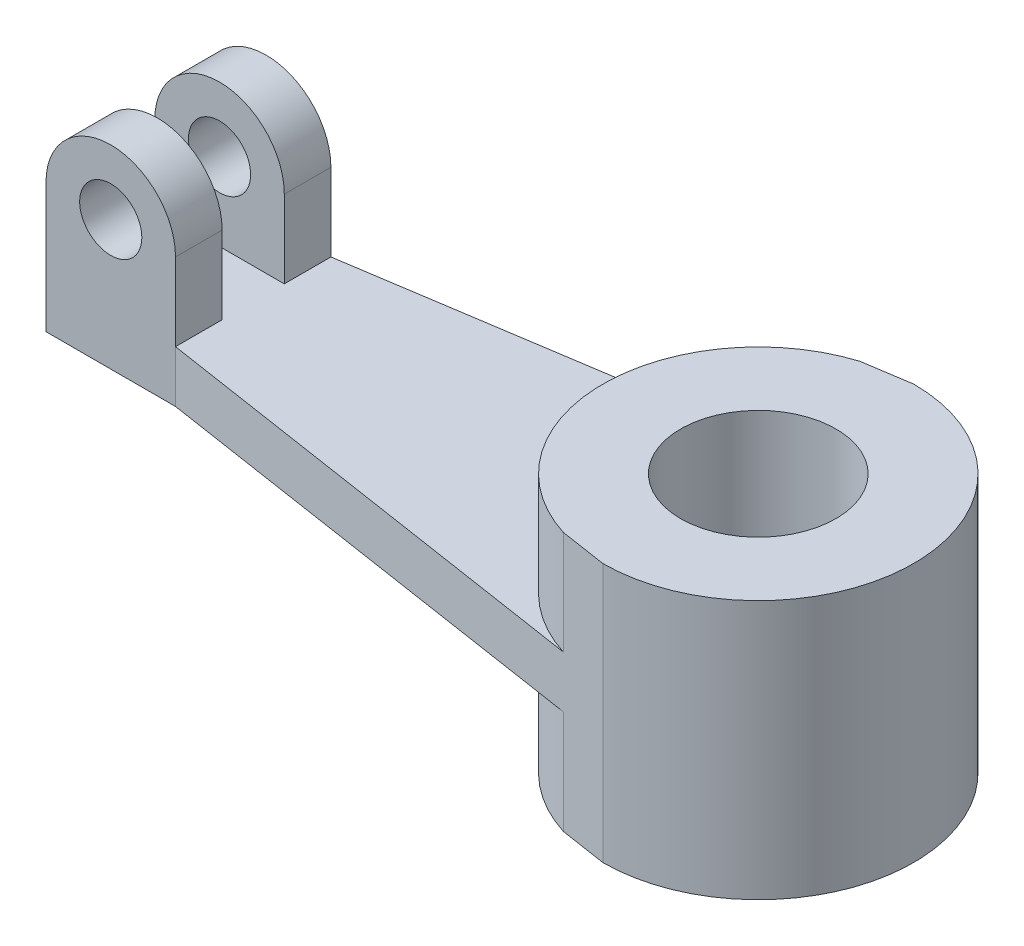
ISO-10303-21;
HEADER;
FILE_DESCRIPTION(('STEP AP214'),'2;1');
FILE_NAME('part.step','',(''),(''),'','','');
FILE_SCHEMA(('AUTOMOTIVE_DESIGN { 1 0 10303 214 1 1 1 1 }'));
ENDSEC;
DATA;
#1=APPLICATION_CONTEXT('core data for automotive mechanical design processes');
#2=APPLICATION_PROTOCOL_DEFINITION('international standard','automotive_design',2000,#1);
#3=PRODUCT_CONTEXT('',#1,'mechanical');
#4=PRODUCT('Part','Part','',(#3));
#5=PRODUCT_RELATED_PRODUCT_CATEGORY('part','',(#4));
#6=PRODUCT_DEFINITION_FORMATION('','',#4);
#7=PRODUCT_DEFINITION_CONTEXT('part definition',#1,'design');
#8=PRODUCT_DEFINITION('design','',#6,#7);
#9=PRODUCT_DEFINITION_SHAPE('','',#8);
#10=(LENGTH_UNIT() NAMED_UNIT(*) SI_UNIT(.MILLI.,.METRE.));
#11=(NAMED_UNIT(*) PLANE_ANGLE_UNIT() SI_UNIT($,.RADIAN.));
#12=(NAMED_UNIT(*) SI_UNIT($,.STERADIAN.) SOLID_ANGLE_UNIT());
#13=UNCERTAINTY_MEASURE_WITH_UNIT(LENGTH_MEASURE(1.E-05),#10,'distance_accuracy_value','');
#14=(GEOMETRIC_REPRESENTATION_CONTEXT(3) GLOBAL_UNCERTAINTY_ASSIGNED_CONTEXT((#13)) GLOBAL_UNIT_ASSIGNED_CONTEXT((#10,
#11,#12)) REPRESENTATION_CONTEXT('',''));
#15=CARTESIAN_POINT('',(0.,0.,0.));
#16=DIRECTION('',(0.,0.,1.));
#17=DIRECTION('',(1.,0.,0.));
#18=AXIS2_PLACEMENT_3D('',#15,#16,#17);
#19=CARTESIAN_POINT('',(0.,10.,0.));
#20=DIRECTION('',(0.,1.,0.));
#21=DIRECTION('',(0.,0.,1.));
#22=AXIS2_PLACEMENT_3D('',#19,#20,#21);
#23=PLANE('',#22);
#24=DIRECTION('',(-1.,0.,0.));
#25=VECTOR('',#24,1.);
#26=CARTESIAN_POINT('',(-122.5,10.,6.));
#27=LINE('',#26,#25);
#28=CARTESIAN_POINT('',(-97.5,10.,6.));
#29=VERTEX_POINT('',#28);
#30=CARTESIAN_POINT('',(-122.5,10.,6.));
#31=VERTEX_POINT('',#30);
#32=EDGE_CURVE('E51',#29,#31,#27,.T.);
#33=ORIENTED_EDGE('',*,*,#32,.F.);
#34=DIRECTION('',(0.,0.,-1.));
#35=VECTOR('',#34,1.);
#36=CARTESIAN_POINT('',(-97.5,10.,6.));
#37=LINE('',#36,#35);
#38=CARTESIAN_POINT('',(-97.5,10.,15.));
#39=VERTEX_POINT('',#38);
#40=EDGE_CURVE('E181',#39,#29,#37,.T.);
#41=ORIENTED_EDGE('',*,*,#40,.F.);
#42=DIRECTION('',(0.988371697650617,0.,0.152057184253941));
#43=VECTOR('',#42,1.);
#44=CARTESIAN_POINT('',(-4.50867052023121,10.,29.3063583815029));
#45=LINE('',#44,#43);
#46=CARTESIAN_POINT('',(-9.01734104046244,10.,28.6127167630058));
#47=VERTEX_POINT('',#46);
#48=EDGE_CURVE('E254',#39,#47,#45,.T.);
#49=ORIENTED_EDGE('',*,*,#48,.T.);
#50=CARTESIAN_POINT('',(0.,10.,0.));
#51=DIRECTION('',(0.,1.,0.));
#52=DIRECTION('',(0.,0.,1.));
#53=AXIS2_PLACEMENT_3D('',#50,#51,#52);
#54=CIRCLE('',#53,30.);
#55=CARTESIAN_POINT('',(-9.01734104046243,10.,-28.6127167630058));
#56=VERTEX_POINT('',#55);
#57=EDGE_CURVE('E246',#56,#47,#54,.T.);
#58=ORIENTED_EDGE('',*,*,#57,.F.);
#59=DIRECTION('',(0.988371697650617,0.,-0.152057184253941));
#60=VECTOR('',#59,1.);
#61=CARTESIAN_POINT('',(-4.50867052023121,10.,-29.3063583815029));
#62=LINE('',#61,#60);
#63=CARTESIAN_POINT('',(-97.5,10.,-15.));
#64=VERTEX_POINT('',#63);
#65=EDGE_CURVE('E256',#64,#56,#62,.T.);
#66=ORIENTED_EDGE('',*,*,#65,.F.);
#67=DIRECTION('',(0.,0.,-1.));
#68=VECTOR('',#67,1.);
#69=CARTESIAN_POINT('',(-97.5,10.,-6.));
#70=LINE('',#69,#68);
#71=CARTESIAN_POINT('',(-97.5,10.,-6.));
#72=VERTEX_POINT('',#71);
#73=EDGE_CURVE('E154',#72,#64,#70,.T.);
#74=ORIENTED_EDGE('',*,*,#73,.F.);
#75=DIRECTION('',(1.,0.,0.));
#76=VECTOR('',#75,1.);
#77=CARTESIAN_POINT('',(-122.5,10.,-6.));
#78=LINE('',#77,#76);
#79=CARTESIAN_POINT('',(-122.5,10.,-6.));
#80=VERTEX_POINT('',#79);
#81=EDGE_CURVE('E200',#80,#72,#78,.T.);
#82=ORIENTED_EDGE('',*,*,#81,.F.);
#83=DIRECTION('',(0.,0.,1.));
#84=VECTOR('',#83,1.);
#85=CARTESIAN_POINT('',(-122.5,10.,0.));
#86=LINE('',#85,#84);
#87=EDGE_CURVE('E56',#80,#31,#86,.T.);
#88=ORIENTED_EDGE('',*,*,#87,.T.);
#89=EDGE_LOOP('',(#33,#41,#49,#58,#66,#74,#82,#88));
#90=FACE_BOUND('',#89,.T.);
#91=ADVANCED_FACE('F35',(#90),#23,.T.);
#92=CARTESIAN_POINT('',(-4.50867052023121,10.,29.3063583815029));
#93=DIRECTION('',(0.152057184253941,0.,-0.988371697650617));
#94=DIRECTION('',(-0.988371697650617,0.,-0.152057184253941));
#95=AXIS2_PLACEMENT_3D('',#92,#93,#94);
#96=PLANE('',#95);
#97=DIRECTION('',(0.988371697650617,0.,0.152057184253941));
#98=VECTOR('',#97,1.);
#99=CARTESIAN_POINT('',(-4.50867052023121,0.,29.3063583815029));
#100=LINE('',#99,#98);
#101=CARTESIAN_POINT('',(-97.5,0.,15.));
#102=VERTEX_POINT('',#101);
#103=CARTESIAN_POINT('',(-9.01734104046243,0.,28.6127167630058));
#104=VERTEX_POINT('',#103);
#105=EDGE_CURVE('E253',#102,#104,#100,.T.);
#106=ORIENTED_EDGE('',*,*,#105,.T.);
#107=DIRECTION('',(0.,1.,0.));
#108=VECTOR('',#107,1.);
#109=CARTESIAN_POINT('',(-9.01734104046244,-20.,28.6127167630058));
#110=LINE('',#109,#108);
#111=CARTESIAN_POINT('',(-9.01734104046244,-20.,28.6127167630058));
#112=VERTEX_POINT('',#111);
#113=EDGE_CURVE('E244',#112,#104,#110,.T.);
#114=ORIENTED_EDGE('',*,*,#113,.F.);
#115=DIRECTION('',(0.988371697650617,0.,0.152057184253941));
#116=VECTOR('',#115,1.);
#117=CARTESIAN_POINT('',(-4.50867052023121,-20.,29.3063583815029));
#118=LINE('',#117,#116);
#119=CARTESIAN_POINT('',(0.,-20.,30.));
#120=VERTEX_POINT('',#119);
#121=EDGE_CURVE('E237',#112,#120,#118,.T.);
#122=ORIENTED_EDGE('',*,*,#121,.T.);
#123=DIRECTION('',(0.,-1.,0.));
#124=VECTOR('',#123,1.);
#125=CARTESIAN_POINT('',(0.,10.,30.));
#126=LINE('',#125,#124);
#127=CARTESIAN_POINT('',(0.,30.,30.));
#128=VERTEX_POINT('',#127);
#129=EDGE_CURVE('E44',#128,#120,#126,.T.);
#130=ORIENTED_EDGE('',*,*,#129,.F.);
#131=DIRECTION('',(0.988371697650617,0.,0.152057184253941));
#132=VECTOR('',#131,1.);
#133=CARTESIAN_POINT('',(-4.50867052023121,30.,29.3063583815029));
#134=LINE('',#133,#132);
#135=CARTESIAN_POINT('',(-9.01734104046244,30.,28.6127167630058));
#136=VERTEX_POINT('',#135);
#137=EDGE_CURVE('E225',#136,#128,#134,.T.);
#138=ORIENTED_EDGE('',*,*,#137,.F.);
#139=EDGE_CURVE('E247',#47,#136,#110,.T.);
#140=ORIENTED_EDGE('',*,*,#139,.F.);
#141=ORIENTED_EDGE('',*,*,#48,.F.);
#142=DIRECTION('',(0.,-1.,0.));
#143=VECTOR('',#142,1.);
#144=CARTESIAN_POINT('',(-97.5,10.,15.));
#145=LINE('',#144,#143);
#146=EDGE_CURVE('E261',#39,#102,#145,.T.);
#147=ORIENTED_EDGE('',*,*,#146,.T.);
#148=EDGE_LOOP('',(#106,#114,#122,#130,#138,#140,#141,#147));
#149=FACE_BOUND('',#148,.T.);
#150=ADVANCED_FACE('F37',(#149),#96,.F.);
#151=CARTESIAN_POINT('',(0.,10.,0.));
#152=DIRECTION('',(0.,-1.,0.));
#153=DIRECTION('',(0.,0.,-1.));
#154=AXIS2_PLACEMENT_3D('',#151,#152,#153);
#155=CYLINDRICAL_SURFACE('',#154,30.);
#156=ORIENTED_EDGE('',*,*,#129,.T.);
#157=CARTESIAN_POINT('',(0.,-20.,0.));
#158=DIRECTION('',(0.,1.,0.));
#159=DIRECTION('',(0.,0.,1.));
#160=AXIS2_PLACEMENT_3D('',#157,#158,#159);
#161=CIRCLE('',#160,30.);
#162=CARTESIAN_POINT('',(0.,-20.,-30.));
#163=VERTEX_POINT('',#162);
#164=EDGE_CURVE('E240',#120,#163,#161,.T.);
#165=ORIENTED_EDGE('',*,*,#164,.T.);
#166=DIRECTION('',(0.,-1.,0.));
#167=VECTOR('',#166,1.);
#168=CARTESIAN_POINT('',(0.,10.,-30.));
#169=LINE('',#168,#167);
#170=CARTESIAN_POINT('',(0.,30.,-30.));
#171=VERTEX_POINT('',#170);
#172=EDGE_CURVE('E276',#171,#163,#169,.T.);
#173=ORIENTED_EDGE('',*,*,#172,.F.);
#174=CARTESIAN_POINT('',(0.,30.,0.));
#175=DIRECTION('',(0.,1.,0.));
#176=DIRECTION('',(0.,0.,1.));
#177=AXIS2_PLACEMENT_3D('',#174,#175,#176);
#178=CIRCLE('',#177,30.);
#179=EDGE_CURVE('E228',#128,#171,#178,.T.);
#180=ORIENTED_EDGE('',*,*,#179,.F.);
#181=EDGE_LOOP('',(#156,#165,#173,#180));
#182=FACE_BOUND('',#181,.T.);
#183=ADVANCED_FACE('F280',(#182),#155,.T.);
#184=CARTESIAN_POINT('',(-4.50867052023121,10.,-29.3063583815029));
#185=DIRECTION('',(-0.152057184253941,0.,-0.988371697650617));
#186=DIRECTION('',(-0.988371697650617,0.,0.152057184253941));
#187=AXIS2_PLACEMENT_3D('',#184,#185,#186);
#188=PLANE('',#187);
#189=ORIENTED_EDGE('',*,*,#65,.T.);
#190=DIRECTION('',(0.,1.,0.));
#191=VECTOR('',#190,1.);
#192=CARTESIAN_POINT('',(-9.01734104046244,-20.,-28.6127167630058));
#193=LINE('',#192,#191);
#194=CARTESIAN_POINT('',(-9.01734104046244,30.,-28.6127167630058));
#195=VERTEX_POINT('',#194);
#196=EDGE_CURVE('E243',#56,#195,#193,.T.);
#197=ORIENTED_EDGE('',*,*,#196,.T.);
#198=DIRECTION('',(-0.988371697650617,0.,0.152057184253941));
#199=VECTOR('',#198,1.);
#200=CARTESIAN_POINT('',(-4.50867052023121,30.,-29.3063583815029));
#201=LINE('',#200,#199);
#202=EDGE_CURVE('E217',#171,#195,#201,.T.);
#203=ORIENTED_EDGE('',*,*,#202,.F.);
#204=ORIENTED_EDGE('',*,*,#172,.T.);
#205=DIRECTION('',(-0.988371697650617,0.,0.152057184253941));
#206=VECTOR('',#205,1.);
#207=CARTESIAN_POINT('',(-4.50867052023121,-20.,-29.3063583815029));
#208=LINE('',#207,#206);
#209=CARTESIAN_POINT('',(-9.01734104046244,-20.,-28.6127167630058));
#210=VERTEX_POINT('',#209);
#211=EDGE_CURVE('E231',#163,#210,#208,.T.);
#212=ORIENTED_EDGE('',*,*,#211,.T.);
#213=CARTESIAN_POINT('',(-9.01734104046244,0.,-28.6127167630058));
#214=VERTEX_POINT('',#213);
#215=EDGE_CURVE('E248',#210,#214,#193,.T.);
#216=ORIENTED_EDGE('',*,*,#215,.T.);
#217=DIRECTION('',(0.988371697650617,0.,-0.152057184253941));
#218=VECTOR('',#217,1.);
#219=CARTESIAN_POINT('',(-4.50867052023121,0.,-29.3063583815029));
#220=LINE('',#219,#218);
#221=CARTESIAN_POINT('',(-97.5,0.,-15.));
#222=VERTEX_POINT('',#221);
#223=EDGE_CURVE('E264',#222,#214,#220,.T.);
#224=ORIENTED_EDGE('',*,*,#223,.F.);
#225=DIRECTION('',(0.,-1.,0.));
#226=VECTOR('',#225,1.);
#227=CARTESIAN_POINT('',(-97.5,10.,-15.));
#228=LINE('',#227,#226);
#229=EDGE_CURVE('E163',#64,#222,#228,.T.);
#230=ORIENTED_EDGE('',*,*,#229,.F.);
#231=EDGE_LOOP('',(#189,#197,#203,#204,#212,#216,#224,#230));
#232=FACE_BOUND('',#231,.T.);
#233=ADVANCED_FACE('F290',(#232),#188,.T.);
#234=CARTESIAN_POINT('',(0.,10.,-15.));
#235=DIRECTION('',(0.,0.,1.));
#236=DIRECTION('',(1.,0.,0.));
#237=AXIS2_PLACEMENT_3D('',#234,#235,#236);
#238=PLANE('',#237);
#239=CARTESIAN_POINT('',(-110.,25.,-15.));
#240=DIRECTION('',(0.,0.,1.));
#241=DIRECTION('',(1.,0.,0.));
#242=AXIS2_PLACEMENT_3D('',#239,#240,#241);
#243=CIRCLE('',#242,6.);
#244=CARTESIAN_POINT('',(-104.,25.,-15.));
#245=VERTEX_POINT('',#244);
#246=EDGE_CURVE('E170',#245,#245,#243,.T.);
#247=ORIENTED_EDGE('',*,*,#246,.T.);
#248=EDGE_LOOP('',(#247));
#249=FACE_BOUND('',#248,.T.);
#250=DIRECTION('',(-1.,0.,0.));
#251=VECTOR('',#250,1.);
#252=CARTESIAN_POINT('',(0.,0.,-15.));
#253=LINE('',#252,#251);
#254=CARTESIAN_POINT('',(-122.5,0.,-15.));
#255=VERTEX_POINT('',#254);
#256=EDGE_CURVE('E162',#222,#255,#253,.T.);
#257=ORIENTED_EDGE('',*,*,#256,.T.);
#258=DIRECTION('',(0.,-1.,0.));
#259=VECTOR('',#258,1.);
#260=CARTESIAN_POINT('',(-122.5,10.,-15.));
#261=LINE('',#260,#259);
#262=CARTESIAN_POINT('',(-122.5,25.,-15.));
#263=VERTEX_POINT('',#262);
#264=EDGE_CURVE('E145',#263,#255,#261,.T.);
#265=ORIENTED_EDGE('',*,*,#264,.F.);
#266=CARTESIAN_POINT('',(-110.,25.,-15.));
#267=DIRECTION('',(0.,0.,-1.));
#268=DIRECTION('',(1.,0.,0.));
#269=AXIS2_PLACEMENT_3D('',#266,#267,#268);
#270=CIRCLE('',#269,12.5);
#271=CARTESIAN_POINT('',(-97.5,25.,-15.));
#272=VERTEX_POINT('',#271);
#273=EDGE_CURVE('E160',#263,#272,#270,.T.);
#274=ORIENTED_EDGE('',*,*,#273,.T.);
#275=DIRECTION('',(0.,-1.,0.));
#276=VECTOR('',#275,1.);
#277=CARTESIAN_POINT('',(-97.5,25.,-15.));
#278=LINE('',#277,#276);
#279=EDGE_CURVE('E203',#272,#64,#278,.T.);
#280=ORIENTED_EDGE('',*,*,#279,.T.);
#281=ORIENTED_EDGE('',*,*,#229,.T.);
#282=EDGE_LOOP('',(#257,#265,#274,#280,#281));
#283=FACE_BOUND('',#282,.T.);
#284=ADVANCED_FACE('F158',(#249,#283),#238,.F.);
#285=CARTESIAN_POINT('',(-122.5,10.,0.));
#286=DIRECTION('',(1.,0.,0.));
#287=DIRECTION('',(0.,0.,-1.));
#288=AXIS2_PLACEMENT_3D('',#285,#286,#287);
#289=PLANE('',#288);
#290=DIRECTION('',(0.,0.,1.));
#291=VECTOR('',#290,1.);
#292=CARTESIAN_POINT('',(-122.5,0.,0.));
#293=LINE('',#292,#291);
#294=CARTESIAN_POINT('',(-122.5,0.,15.));
#295=VERTEX_POINT('',#294);
#296=EDGE_CURVE('E268',#255,#295,#293,.T.);
#297=ORIENTED_EDGE('',*,*,#296,.T.);
#298=DIRECTION('',(0.,-1.,0.));
#299=VECTOR('',#298,1.);
#300=CARTESIAN_POINT('',(-122.5,10.,15.));
#301=LINE('',#300,#299);
#302=CARTESIAN_POINT('',(-122.5,25.,15.));
#303=VERTEX_POINT('',#302);
#304=EDGE_CURVE('E164',#303,#295,#301,.T.);
#305=ORIENTED_EDGE('',*,*,#304,.F.);
#306=DIRECTION('',(0.,0.,1.));
#307=VECTOR('',#306,1.);
#308=CARTESIAN_POINT('',(-122.5,25.,15.));
#309=LINE('',#308,#307);
#310=CARTESIAN_POINT('',(-122.5,25.,6.));
#311=VERTEX_POINT('',#310);
#312=EDGE_CURVE('E184',#311,#303,#309,.T.);
#313=ORIENTED_EDGE('',*,*,#312,.F.);
#314=DIRECTION('',(0.,-1.,0.));
#315=VECTOR('',#314,1.);
#316=CARTESIAN_POINT('',(-122.5,25.,6.));
#317=LINE('',#316,#315);
#318=EDGE_CURVE('E190',#311,#31,#317,.T.);
#319=ORIENTED_EDGE('',*,*,#318,.T.);
#320=ORIENTED_EDGE('',*,*,#87,.F.);
#321=DIRECTION('',(0.,-1.,0.));
#322=VECTOR('',#321,1.);
#323=CARTESIAN_POINT('',(-122.5,25.,-6.));
#324=LINE('',#323,#322);
#325=CARTESIAN_POINT('',(-122.5,25.,-6.));
#326=VERTEX_POINT('',#325);
#327=EDGE_CURVE('E148',#326,#80,#324,.T.);
#328=ORIENTED_EDGE('',*,*,#327,.F.);
#329=DIRECTION('',(0.,0.,1.));
#330=VECTOR('',#329,1.);
#331=CARTESIAN_POINT('',(-122.5,25.,-15.));
#332=LINE('',#331,#330);
#333=EDGE_CURVE('E142',#263,#326,#332,.T.);
#334=ORIENTED_EDGE('',*,*,#333,.F.);
#335=ORIENTED_EDGE('',*,*,#264,.T.);
#336=EDGE_LOOP('',(#297,#305,#313,#319,#320,#328,#334,#335));
#337=FACE_BOUND('',#336,.T.);
#338=ADVANCED_FACE('F144',(#337),#289,.F.);
#339=CARTESIAN_POINT('',(0.,10.,15.));
#340=DIRECTION('',(0.,0.,-1.));
#341=DIRECTION('',(-1.,0.,0.));
#342=AXIS2_PLACEMENT_3D('',#339,#340,#341);
#343=PLANE('',#342);
#344=CARTESIAN_POINT('',(-110.,25.,15.));
#345=DIRECTION('',(0.,0.,1.));
#346=DIRECTION('',(1.,0.,0.));
#347=AXIS2_PLACEMENT_3D('',#344,#345,#346);
#348=CIRCLE('',#347,6.);
#349=CARTESIAN_POINT('',(-104.,25.,15.));
#350=VERTEX_POINT('',#349);
#351=EDGE_CURVE('E462',#350,#350,#348,.T.);
#352=ORIENTED_EDGE('',*,*,#351,.F.);
#353=EDGE_LOOP('',(#352));
#354=FACE_BOUND('',#353,.T.);
#355=DIRECTION('',(1.,0.,0.));
#356=VECTOR('',#355,1.);
#357=CARTESIAN_POINT('',(0.,0.,15.));
#358=LINE('',#357,#356);
#359=EDGE_CURVE('E257',#295,#102,#358,.T.);
#360=ORIENTED_EDGE('',*,*,#359,.T.);
#361=ORIENTED_EDGE('',*,*,#146,.F.);
#362=DIRECTION('',(0.,-1.,0.));
#363=VECTOR('',#362,1.);
#364=CARTESIAN_POINT('',(-97.5,25.,15.));
#365=LINE('',#364,#363);
#366=CARTESIAN_POINT('',(-97.5,25.,15.));
#367=VERTEX_POINT('',#366);
#368=EDGE_CURVE('E198',#367,#39,#365,.T.);
#369=ORIENTED_EDGE('',*,*,#368,.F.);
#370=CARTESIAN_POINT('',(-110.,25.,15.));
#371=DIRECTION('',(0.,0.,1.));
#372=DIRECTION('',(1.,0.,0.));
#373=AXIS2_PLACEMENT_3D('',#370,#371,#372);
#374=CIRCLE('',#373,12.5);
#375=EDGE_CURVE('E172',#303,#367,#374,.F.);
#376=ORIENTED_EDGE('',*,*,#375,.F.);
#377=ORIENTED_EDGE('',*,*,#304,.T.);
#378=EDGE_LOOP('',(#360,#361,#369,#376,#377));
#379=FACE_BOUND('',#378,.T.);
#380=ADVANCED_FACE('F309',(#354,#379),#343,.F.);
#381=CARTESIAN_POINT('',(0.,0.,0.));
#382=DIRECTION('',(0.,1.,0.));
#383=DIRECTION('',(0.,0.,1.));
#384=AXIS2_PLACEMENT_3D('',#381,#382,#383);
#385=PLANE('',#384);
#386=ORIENTED_EDGE('',*,*,#223,.T.);
#387=CARTESIAN_POINT('',(0.,0.,0.));
#388=DIRECTION('',(0.,1.,0.));
#389=DIRECTION('',(0.,0.,1.));
#390=AXIS2_PLACEMENT_3D('',#387,#388,#389);
#391=CIRCLE('',#390,30.);
#392=EDGE_CURVE('E11',#214,#104,#391,.T.);
#393=ORIENTED_EDGE('',*,*,#392,.T.);
#394=ORIENTED_EDGE('',*,*,#105,.F.);
#395=ORIENTED_EDGE('',*,*,#359,.F.);
#396=ORIENTED_EDGE('',*,*,#296,.F.);
#397=ORIENTED_EDGE('',*,*,#256,.F.);
#398=EDGE_LOOP('',(#386,#393,#394,#395,#396,#397));
#399=FACE_BOUND('',#398,.T.);
#400=ADVANCED_FACE('F303',(#399),#385,.F.);
#401=CARTESIAN_POINT('',(0.,-20.,0.));
#402=DIRECTION('',(0.,1.,0.));
#403=DIRECTION('',(0.,0.,1.));
#404=AXIS2_PLACEMENT_3D('',#401,#402,#403);
#405=PLANE('',#404);
#406=CARTESIAN_POINT('',(0.,-20.,0.));
#407=DIRECTION('',(0.,1.,0.));
#408=DIRECTION('',(0.,0.,1.));
#409=AXIS2_PLACEMENT_3D('',#406,#407,#408);
#410=CIRCLE('',#409,15.);
#411=CARTESIAN_POINT('',(0.,-20.,15.));
#412=VERTEX_POINT('',#411);
#413=EDGE_CURVE('E214',#412,#412,#410,.T.);
#414=ORIENTED_EDGE('',*,*,#413,.T.);
#415=EDGE_LOOP('',(#414));
#416=FACE_BOUND('',#415,.T.);
#417=ORIENTED_EDGE('',*,*,#211,.F.);
#418=ORIENTED_EDGE('',*,*,#164,.F.);
#419=ORIENTED_EDGE('',*,*,#121,.F.);
#420=CARTESIAN_POINT('',(0.,-20.,0.));
#421=DIRECTION('',(0.,1.,0.));
#422=DIRECTION('',(0.,0.,1.));
#423=AXIS2_PLACEMENT_3D('',#420,#421,#422);
#424=CIRCLE('',#423,30.);
#425=EDGE_CURVE('E234',#210,#112,#424,.T.);
#426=ORIENTED_EDGE('',*,*,#425,.F.);
#427=EDGE_LOOP('',(#417,#418,#419,#426));
#428=FACE_BOUND('',#427,.T.);
#429=ADVANCED_FACE('F288',(#416,#428),#405,.F.);
#430=CARTESIAN_POINT('',(0.,-20.,0.));
#431=DIRECTION('',(0.,1.,0.));
#432=DIRECTION('',(0.,0.,1.));
#433=AXIS2_PLACEMENT_3D('',#430,#431,#432);
#434=CYLINDRICAL_SURFACE('',#433,30.);
#435=ORIENTED_EDGE('',*,*,#392,.F.);
#436=ORIENTED_EDGE('',*,*,#215,.F.);
#437=ORIENTED_EDGE('',*,*,#425,.T.);
#438=ORIENTED_EDGE('',*,*,#113,.T.);
#439=EDGE_LOOP('',(#435,#436,#437,#438));
#440=FACE_BOUND('',#439,.T.);
#441=ADVANCED_FACE('F385',(#440),#434,.T.);
#442=ORIENTED_EDGE('',*,*,#196,.F.);
#443=ORIENTED_EDGE('',*,*,#57,.T.);
#444=ORIENTED_EDGE('',*,*,#139,.T.);
#445=CARTESIAN_POINT('',(0.,30.,0.));
#446=DIRECTION('',(0.,1.,0.));
#447=DIRECTION('',(0.,0.,1.));
#448=AXIS2_PLACEMENT_3D('',#445,#446,#447);
#449=CIRCLE('',#448,30.);
#450=EDGE_CURVE('E222',#195,#136,#449,.T.);
#451=ORIENTED_EDGE('',*,*,#450,.F.);
#452=EDGE_LOOP('',(#442,#443,#444,#451));
#453=FACE_BOUND('',#452,.T.);
#454=ADVANCED_FACE('F300',(#453),#434,.T.);
#455=CARTESIAN_POINT('',(0.,30.,0.));
#456=DIRECTION('',(0.,1.,0.));
#457=DIRECTION('',(0.,0.,1.));
#458=AXIS2_PLACEMENT_3D('',#455,#456,#457);
#459=PLANE('',#458);
#460=CARTESIAN_POINT('',(0.,30.,0.));
#461=DIRECTION('',(0.,1.,0.));
#462=DIRECTION('',(0.,0.,1.));
#463=AXIS2_PLACEMENT_3D('',#460,#461,#462);
#464=CIRCLE('',#463,15.);
#465=CARTESIAN_POINT('',(0.,30.,15.));
#466=VERTEX_POINT('',#465);
#467=EDGE_CURVE('E213',#466,#466,#464,.T.);
#468=ORIENTED_EDGE('',*,*,#467,.F.);
#469=EDGE_LOOP('',(#468));
#470=FACE_BOUND('',#469,.T.);
#471=ORIENTED_EDGE('',*,*,#202,.T.);
#472=ORIENTED_EDGE('',*,*,#450,.T.);
#473=ORIENTED_EDGE('',*,*,#137,.T.);
#474=ORIENTED_EDGE('',*,*,#179,.T.);
#475=EDGE_LOOP('',(#471,#472,#473,#474));
#476=FACE_BOUND('',#475,.T.);
#477=ADVANCED_FACE('F294',(#470,#476),#459,.T.);
#478=CARTESIAN_POINT('',(0.,-20.,0.));
#479=DIRECTION('',(0.,1.,0.));
#480=DIRECTION('',(0.,0.,1.));
#481=AXIS2_PLACEMENT_3D('',#478,#479,#480);
#482=CYLINDRICAL_SURFACE('',#481,15.);
#483=ORIENTED_EDGE('',*,*,#413,.F.);
#484=EDGE_LOOP('',(#483));
#485=FACE_BOUND('',#484,.T.);
#486=ORIENTED_EDGE('',*,*,#467,.T.);
#487=EDGE_LOOP('',(#486));
#488=FACE_BOUND('',#487,.T.);
#489=ADVANCED_FACE('F402',(#485,#488),#482,.F.);
#490=CARTESIAN_POINT('',(-122.5,25.,-6.));
#491=DIRECTION('',(0.,0.,-1.));
#492=DIRECTION('',(-1.,0.,0.));
#493=AXIS2_PLACEMENT_3D('',#490,#491,#492);
#494=PLANE('',#493);
#495=CARTESIAN_POINT('',(-110.,25.,-6.));
#496=DIRECTION('',(0.,0.,-1.));
#497=DIRECTION('',(-1.,0.,0.));
#498=AXIS2_PLACEMENT_3D('',#495,#496,#497);
#499=CIRCLE('',#498,6.);
#500=CARTESIAN_POINT('',(-116.,25.,-6.));
#501=VERTEX_POINT('',#500);
#502=EDGE_CURVE('E175',#501,#501,#499,.T.);
#503=ORIENTED_EDGE('',*,*,#502,.T.);
#504=EDGE_LOOP('',(#503));
#505=FACE_BOUND('',#504,.T.);
#506=ORIENTED_EDGE('',*,*,#81,.T.);
#507=DIRECTION('',(0.,-1.,0.));
#508=VECTOR('',#507,1.);
#509=CARTESIAN_POINT('',(-97.5,25.,-6.));
#510=LINE('',#509,#508);
#511=CARTESIAN_POINT('',(-97.5,25.,-6.));
#512=VERTEX_POINT('',#511);
#513=EDGE_CURVE('E209',#512,#72,#510,.T.);
#514=ORIENTED_EDGE('',*,*,#513,.F.);
#515=CARTESIAN_POINT('',(-110.,25.,-6.));
#516=DIRECTION('',(0.,0.,-1.));
#517=DIRECTION('',(1.,0.,0.));
#518=AXIS2_PLACEMENT_3D('',#515,#516,#517);
#519=CIRCLE('',#518,12.5);
#520=EDGE_CURVE('E169',#326,#512,#519,.T.);
#521=ORIENTED_EDGE('',*,*,#520,.F.);
#522=ORIENTED_EDGE('',*,*,#327,.T.);
#523=EDGE_LOOP('',(#506,#514,#521,#522));
#524=FACE_BOUND('',#523,.T.);
#525=ADVANCED_FACE('F327',(#505,#524),#494,.F.);
#526=CARTESIAN_POINT('',(-97.5,25.,-6.));
#527=DIRECTION('',(-1.,0.,0.));
#528=DIRECTION('',(0.,0.,1.));
#529=AXIS2_PLACEMENT_3D('',#526,#527,#528);
#530=PLANE('',#529);
#531=ORIENTED_EDGE('',*,*,#73,.T.);
#532=ORIENTED_EDGE('',*,*,#279,.F.);
#533=DIRECTION('',(0.,0.,-1.));
#534=VECTOR('',#533,1.);
#535=CARTESIAN_POINT('',(-97.5,25.,-6.));
#536=LINE('',#535,#534);
#537=EDGE_CURVE('E153',#512,#272,#536,.T.);
#538=ORIENTED_EDGE('',*,*,#537,.F.);
#539=ORIENTED_EDGE('',*,*,#513,.T.);
#540=EDGE_LOOP('',(#531,#532,#538,#539));
#541=FACE_BOUND('',#540,.T.);
#542=ADVANCED_FACE('F319',(#541),#530,.F.);
#543=CARTESIAN_POINT('',(-97.5,25.,6.));
#544=DIRECTION('',(-1.,0.,0.));
#545=DIRECTION('',(0.,0.,1.));
#546=AXIS2_PLACEMENT_3D('',#543,#544,#545);
#547=PLANE('',#546);
#548=ORIENTED_EDGE('',*,*,#40,.T.);
#549=DIRECTION('',(0.,-1.,0.));
#550=VECTOR('',#549,1.);
#551=CARTESIAN_POINT('',(-97.5,25.,6.));
#552=LINE('',#551,#550);
#553=CARTESIAN_POINT('',(-97.5,25.,6.));
#554=VERTEX_POINT('',#553);
#555=EDGE_CURVE('E195',#554,#29,#552,.T.);
#556=ORIENTED_EDGE('',*,*,#555,.F.);
#557=DIRECTION('',(0.,0.,-1.));
#558=VECTOR('',#557,1.);
#559=CARTESIAN_POINT('',(-97.5,25.,6.));
#560=LINE('',#559,#558);
#561=EDGE_CURVE('E187',#367,#554,#560,.T.);
#562=ORIENTED_EDGE('',*,*,#561,.F.);
#563=ORIENTED_EDGE('',*,*,#368,.T.);
#564=EDGE_LOOP('',(#548,#556,#562,#563));
#565=FACE_BOUND('',#564,.T.);
#566=ADVANCED_FACE('F317',(#565),#547,.F.);
#567=CARTESIAN_POINT('',(-122.5,25.,6.));
#568=DIRECTION('',(0.,0.,1.));
#569=DIRECTION('',(1.,0.,0.));
#570=AXIS2_PLACEMENT_3D('',#567,#568,#569);
#571=PLANE('',#570);
#572=CARTESIAN_POINT('',(-110.,25.,6.));
#573=DIRECTION('',(0.,0.,1.));
#574=DIRECTION('',(1.,0.,0.));
#575=AXIS2_PLACEMENT_3D('',#572,#573,#574);
#576=CIRCLE('',#575,6.);
#577=CARTESIAN_POINT('',(-104.,25.,6.));
#578=VERTEX_POINT('',#577);
#579=EDGE_CURVE('E39',#578,#578,#576,.T.);
#580=ORIENTED_EDGE('',*,*,#579,.T.);
#581=EDGE_LOOP('',(#580));
#582=FACE_BOUND('',#581,.T.);
#583=ORIENTED_EDGE('',*,*,#32,.T.);
#584=ORIENTED_EDGE('',*,*,#318,.F.);
#585=CARTESIAN_POINT('',(-110.,25.,6.));
#586=DIRECTION('',(0.,0.,1.));
#587=DIRECTION('',(1.,0.,0.));
#588=AXIS2_PLACEMENT_3D('',#585,#586,#587);
#589=CIRCLE('',#588,12.5);
#590=EDGE_CURVE('E178',#311,#554,#589,.F.);
#591=ORIENTED_EDGE('',*,*,#590,.T.);
#592=ORIENTED_EDGE('',*,*,#555,.T.);
#593=EDGE_LOOP('',(#583,#584,#591,#592));
#594=FACE_BOUND('',#593,.T.);
#595=ADVANCED_FACE('F315',(#582,#594),#571,.F.);
#596=CARTESIAN_POINT('',(-110.,25.,6.));
#597=DIRECTION('',(0.,0.,1.));
#598=DIRECTION('',(1.,0.,0.));
#599=AXIS2_PLACEMENT_3D('',#596,#597,#598);
#600=CYLINDRICAL_SURFACE('',#599,12.5);
#601=ORIENTED_EDGE('',*,*,#375,.T.);
#602=ORIENTED_EDGE('',*,*,#561,.T.);
#603=ORIENTED_EDGE('',*,*,#590,.F.);
#604=ORIENTED_EDGE('',*,*,#312,.T.);
#605=EDGE_LOOP('',(#601,#602,#603,#604));
#606=FACE_BOUND('',#605,.T.);
#607=ADVANCED_FACE('F312',(#606),#600,.T.);
#608=CARTESIAN_POINT('',(-110.,25.,-6.));
#609=DIRECTION('',(0.,0.,-1.));
#610=DIRECTION('',(-1.,0.,0.));
#611=AXIS2_PLACEMENT_3D('',#608,#609,#610);
#612=CYLINDRICAL_SURFACE('',#611,12.5);
#613=ORIENTED_EDGE('',*,*,#273,.F.);
#614=ORIENTED_EDGE('',*,*,#333,.T.);
#615=ORIENTED_EDGE('',*,*,#520,.T.);
#616=ORIENTED_EDGE('',*,*,#537,.T.);
#617=EDGE_LOOP('',(#613,#614,#615,#616));
#618=FACE_BOUND('',#617,.T.);
#619=ADVANCED_FACE('F167',(#618),#612,.T.);
#620=CARTESIAN_POINT('',(-110.,25.,-30.));
#621=DIRECTION('',(0.,0.,1.));
#622=DIRECTION('',(1.,0.,0.));
#623=AXIS2_PLACEMENT_3D('',#620,#621,#622);
#624=CYLINDRICAL_SURFACE('',#623,6.);
#625=ORIENTED_EDGE('',*,*,#351,.T.);
#626=EDGE_LOOP('',(#625));
#627=FACE_BOUND('',#626,.T.);
#628=ORIENTED_EDGE('',*,*,#579,.F.);
#629=EDGE_LOOP('',(#628));
#630=FACE_BOUND('',#629,.T.);
#631=ADVANCED_FACE('F430',(#627,#630),#624,.F.);
#632=ORIENTED_EDGE('',*,*,#502,.F.);
#633=EDGE_LOOP('',(#632));
#634=FACE_BOUND('',#633,.T.);
#635=ORIENTED_EDGE('',*,*,#246,.F.);
#636=EDGE_LOOP('',(#635));
#637=FACE_BOUND('',#636,.T.);
#638=ADVANCED_FACE('F442',(#634,#637),#624,.F.);
#639=CLOSED_SHELL('',(#91,#150,#183,#233,#284,#338,#380,#400,#429,#441,#454,#477,#489,#525,#542,
#566,#595,#607,#619,#631,#638));
#640=MANIFOLD_SOLID_BREP('B2',#639);
#641=ADVANCED_BREP_SHAPE_REPRESENTATION('',(#18,#640),#14);
#642=SHAPE_DEFINITION_REPRESENTATION(#9,#641);
ENDSEC;
END-ISO-10303-21;
